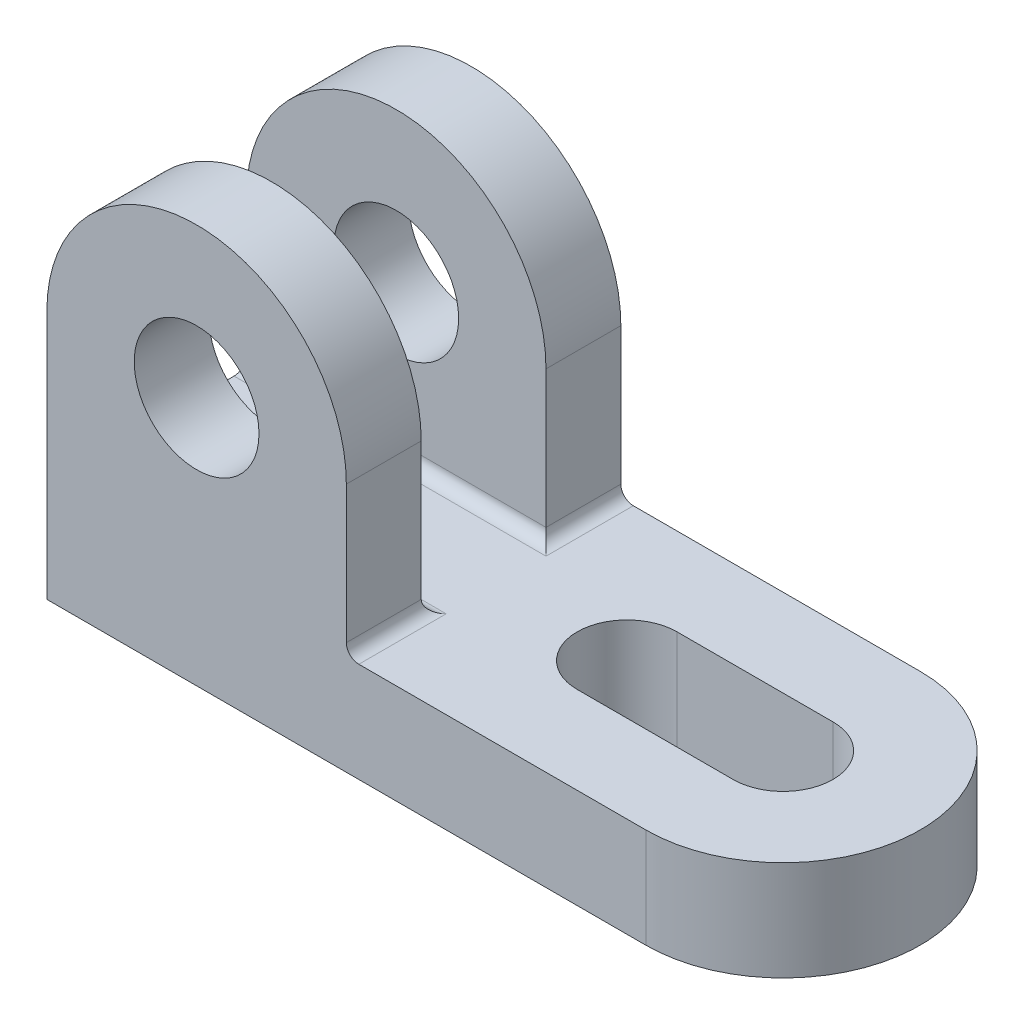
ISO-10303-21;
HEADER;
FILE_DESCRIPTION(('STEP AP214'),'2;1');
FILE_NAME('part.step','',(''),(''),'','','');
FILE_SCHEMA(('AUTOMOTIVE_DESIGN { 1 0 10303 214 1 1 1 1 }'));
ENDSEC;
DATA;
#1=APPLICATION_CONTEXT('core data for automotive mechanical design processes');
#2=APPLICATION_PROTOCOL_DEFINITION('international standard','automotive_design',2000,#1);
#3=PRODUCT_CONTEXT('',#1,'mechanical');
#4=PRODUCT('Part','Part','',(#3));
#5=PRODUCT_RELATED_PRODUCT_CATEGORY('part','',(#4));
#6=PRODUCT_DEFINITION_FORMATION('','',#4);
#7=PRODUCT_DEFINITION_CONTEXT('part definition',#1,'design');
#8=PRODUCT_DEFINITION('design','',#6,#7);
#9=PRODUCT_DEFINITION_SHAPE('','',#8);
#10=(LENGTH_UNIT() NAMED_UNIT(*) SI_UNIT(.MILLI.,.METRE.));
#11=(NAMED_UNIT(*) PLANE_ANGLE_UNIT() SI_UNIT($,.RADIAN.));
#12=(NAMED_UNIT(*) SI_UNIT($,.STERADIAN.) SOLID_ANGLE_UNIT());
#13=UNCERTAINTY_MEASURE_WITH_UNIT(LENGTH_MEASURE(1.E-05),#10,'distance_accuracy_value','');
#14=(GEOMETRIC_REPRESENTATION_CONTEXT(3) GLOBAL_UNCERTAINTY_ASSIGNED_CONTEXT((#13)) GLOBAL_UNIT_ASSIGNED_CONTEXT((#10,
#11,#12)) REPRESENTATION_CONTEXT('',''));
#15=CARTESIAN_POINT('',(0.,0.,0.));
#16=DIRECTION('',(0.,0.,1.));
#17=DIRECTION('',(1.,0.,0.));
#18=AXIS2_PLACEMENT_3D('',#15,#16,#17);
#19=CARTESIAN_POINT('',(0.,16.,0.));
#20=DIRECTION('',(0.,1.,0.));
#21=DIRECTION('',(0.,0.,1.));
#22=AXIS2_PLACEMENT_3D('',#19,#20,#21);
#23=PLANE('',#22);
#24=CARTESIAN_POINT('',(37.,16.,0.));
#25=DIRECTION('',(0.,1.,0.));
#26=DIRECTION('',(0.,0.,1.));
#27=AXIS2_PLACEMENT_3D('',#24,#25,#26);
#28=CIRCLE('',#27,7.99999999999999);
#29=CARTESIAN_POINT('',(37.,16.,7.99999999999999));
#30=VERTEX_POINT('',#29);
#31=CARTESIAN_POINT('',(37.,16.,-7.99999999999999));
#32=VERTEX_POINT('',#31);
#33=EDGE_CURVE('E249',#30,#32,#28,.T.);
#34=ORIENTED_EDGE('',*,*,#33,.F.);
#35=DIRECTION('',(1.,0.,0.));
#36=VECTOR('',#35,1.);
#37=CARTESIAN_POINT('',(37.,16.,7.99999999999999));
#38=LINE('',#37,#36);
#39=CARTESIAN_POINT('',(12.,16.,8.));
#40=VERTEX_POINT('',#39);
#41=EDGE_CURVE('E258',#40,#30,#38,.T.);
#42=ORIENTED_EDGE('',*,*,#41,.F.);
#43=CARTESIAN_POINT('',(12.,16.,0.));
#44=DIRECTION('',(0.,1.,0.));
#45=DIRECTION('',(0.,0.,1.));
#46=AXIS2_PLACEMENT_3D('',#43,#44,#45);
#47=CIRCLE('',#46,8.);
#48=CARTESIAN_POINT('',(12.,16.,-7.99999999999999));
#49=VERTEX_POINT('',#48);
#50=EDGE_CURVE('E277',#49,#40,#47,.T.);
#51=ORIENTED_EDGE('',*,*,#50,.F.);
#52=DIRECTION('',(-1.,0.,0.));
#53=VECTOR('',#52,1.);
#54=CARTESIAN_POINT('',(37.,16.,-7.99999999999999));
#55=LINE('',#54,#53);
#56=EDGE_CURVE('E273',#32,#49,#55,.T.);
#57=ORIENTED_EDGE('',*,*,#56,.F.);
#58=EDGE_LOOP('',(#34,#42,#51,#57));
#59=FACE_BOUND('',#58,.T.);
#60=DIRECTION('',(0.,0.,-1.));
#61=VECTOR('',#60,1.);
#62=CARTESIAN_POINT('',(-9.00000000000001,16.,0.));
#63=LINE('',#62,#61);
#64=CARTESIAN_POINT('',(-9.00000000000001,16.,-22.));
#65=VERTEX_POINT('',#64);
#66=CARTESIAN_POINT('',(-9.00000000000001,16.,-7.99999999999999));
#67=VERTEX_POINT('',#66);
#68=EDGE_CURVE('E345',#65,#67,#63,.F.);
#69=ORIENTED_EDGE('',*,*,#68,.T.);
#70=DIRECTION('',(-1.,0.,0.));
#71=VECTOR('',#70,1.);
#72=CARTESIAN_POINT('',(0.,16.,-7.99999999999999));
#73=LINE('',#72,#71);
#74=CARTESIAN_POINT('',(-59.,16.,-7.99999999999999));
#75=VERTEX_POINT('',#74);
#76=EDGE_CURVE('E348',#67,#75,#73,.T.);
#77=ORIENTED_EDGE('',*,*,#76,.T.);
#78=DIRECTION('',(0.,0.,1.));
#79=VECTOR('',#78,1.);
#80=CARTESIAN_POINT('',(-59.,16.,0.));
#81=LINE('',#80,#79);
#82=CARTESIAN_POINT('',(-59.,16.,7.99999999999999));
#83=VERTEX_POINT('',#82);
#84=EDGE_CURVE('E308',#75,#83,#81,.T.);
#85=ORIENTED_EDGE('',*,*,#84,.T.);
#86=DIRECTION('',(-1.,0.,0.));
#87=VECTOR('',#86,1.);
#88=CARTESIAN_POINT('',(0.,16.,7.99999999999999));
#89=LINE('',#88,#87);
#90=CARTESIAN_POINT('',(-9.00000000000001,16.,7.99999999999999));
#91=VERTEX_POINT('',#90);
#92=EDGE_CURVE('E342',#83,#91,#89,.F.);
#93=ORIENTED_EDGE('',*,*,#92,.T.);
#94=DIRECTION('',(0.,0.,1.));
#95=VECTOR('',#94,1.);
#96=CARTESIAN_POINT('',(-9.00000000000001,16.,22.));
#97=LINE('',#96,#95);
#98=CARTESIAN_POINT('',(-9.00000000000001,16.,22.));
#99=VERTEX_POINT('',#98);
#100=EDGE_CURVE('E339',#91,#99,#97,.T.);
#101=ORIENTED_EDGE('',*,*,#100,.T.);
#102=DIRECTION('',(1.,0.,0.));
#103=VECTOR('',#102,1.);
#104=CARTESIAN_POINT('',(0.,16.,22.));
#105=LINE('',#104,#103);
#106=CARTESIAN_POINT('',(37.,16.,22.));
#107=VERTEX_POINT('',#106);
#108=EDGE_CURVE('E297',#99,#107,#105,.T.);
#109=ORIENTED_EDGE('',*,*,#108,.T.);
#110=CARTESIAN_POINT('',(37.,16.,0.));
#111=DIRECTION('',(0.,1.,0.));
#112=DIRECTION('',(0.,0.,1.));
#113=AXIS2_PLACEMENT_3D('',#110,#111,#112);
#114=CIRCLE('',#113,22.);
#115=CARTESIAN_POINT('',(37.,16.,-22.));
#116=VERTEX_POINT('',#115);
#117=EDGE_CURVE('E300',#107,#116,#114,.T.);
#118=ORIENTED_EDGE('',*,*,#117,.T.);
#119=DIRECTION('',(1.,0.,0.));
#120=VECTOR('',#119,1.);
#121=CARTESIAN_POINT('',(0.,16.,-22.));
#122=LINE('',#121,#120);
#123=EDGE_CURVE('E305',#65,#116,#122,.T.);
#124=ORIENTED_EDGE('',*,*,#123,.F.);
#125=EDGE_LOOP('',(#69,#77,#85,#93,#101,#109,#118,#124));
#126=FACE_BOUND('',#125,.T.);
#127=ADVANCED_FACE('F49',(#59,#126),#23,.T.);
#128=CARTESIAN_POINT('',(0.,16.,22.));
#129=DIRECTION('',(0.,0.,-1.));
#130=DIRECTION('',(-1.,0.,0.));
#131=AXIS2_PLACEMENT_3D('',#128,#129,#130);
#132=PLANE('',#131);
#133=DIRECTION('',(1.,0.,0.));
#134=VECTOR('',#133,1.);
#135=CARTESIAN_POINT('',(0.,0.,22.));
#136=LINE('',#135,#134);
#137=CARTESIAN_POINT('',(-59.,0.,22.));
#138=VERTEX_POINT('',#137);
#139=CARTESIAN_POINT('',(37.,0.,22.));
#140=VERTEX_POINT('',#139);
#141=EDGE_CURVE('E287',#138,#140,#136,.T.);
#142=ORIENTED_EDGE('',*,*,#141,.T.);
#143=DIRECTION('',(0.,-1.,0.));
#144=VECTOR('',#143,1.);
#145=CARTESIAN_POINT('',(37.,16.,22.));
#146=LINE('',#145,#144);
#147=EDGE_CURVE('E335',#107,#140,#146,.T.);
#148=ORIENTED_EDGE('',*,*,#147,.F.);
#149=ORIENTED_EDGE('',*,*,#108,.F.);
#150=CARTESIAN_POINT('',(-9.00000000000001,18.,22.));
#151=DIRECTION('',(0.,0.,-1.));
#152=DIRECTION('',(-1.,0.,0.));
#153=AXIS2_PLACEMENT_3D('',#150,#151,#152);
#154=CIRCLE('',#153,2.);
#155=CARTESIAN_POINT('',(-11.,18.,22.));
#156=VERTEX_POINT('',#155);
#157=EDGE_CURVE('E11',#99,#156,#154,.T.);
#158=ORIENTED_EDGE('',*,*,#157,.T.);
#159=DIRECTION('',(0.,1.,0.));
#160=VECTOR('',#159,1.);
#161=CARTESIAN_POINT('',(-11.,0.,22.));
#162=LINE('',#161,#160);
#163=CARTESIAN_POINT('',(-11.,40.,22.));
#164=VERTEX_POINT('',#163);
#165=EDGE_CURVE('E239',#156,#164,#162,.T.);
#166=ORIENTED_EDGE('',*,*,#165,.T.);
#167=CARTESIAN_POINT('',(-35.,40.,22.));
#168=DIRECTION('',(0.,0.,1.));
#169=DIRECTION('',(1.,0.,0.));
#170=AXIS2_PLACEMENT_3D('',#167,#168,#169);
#171=CIRCLE('',#170,24.);
#172=CARTESIAN_POINT('',(-59.,40.,22.));
#173=VERTEX_POINT('',#172);
#174=EDGE_CURVE('E218',#164,#173,#171,.T.);
#175=ORIENTED_EDGE('',*,*,#174,.T.);
#176=DIRECTION('',(0.,-1.,0.));
#177=VECTOR('',#176,1.);
#178=CARTESIAN_POINT('',(-59.,16.,22.));
#179=LINE('',#178,#177);
#180=EDGE_CURVE('E312',#173,#138,#179,.T.);
#181=ORIENTED_EDGE('',*,*,#180,.T.);
#182=EDGE_LOOP('',(#142,#148,#149,#158,#166,#175,#181));
#183=FACE_BOUND('',#182,.T.);
#184=CARTESIAN_POINT('',(-35.,40.,22.));
#185=DIRECTION('',(0.,0.,1.));
#186=DIRECTION('',(1.,0.,0.));
#187=AXIS2_PLACEMENT_3D('',#184,#185,#186);
#188=CIRCLE('',#187,10.);
#189=CARTESIAN_POINT('',(-25.,40.,22.));
#190=VERTEX_POINT('',#189);
#191=EDGE_CURVE('E225',#190,#190,#188,.T.);
#192=ORIENTED_EDGE('',*,*,#191,.F.);
#193=EDGE_LOOP('',(#192));
#194=FACE_BOUND('',#193,.T.);
#195=ADVANCED_FACE('F385',(#183,#194),#132,.F.);
#196=CARTESIAN_POINT('',(37.,16.,0.));
#197=DIRECTION('',(0.,-1.,0.));
#198=DIRECTION('',(0.,0.,-1.));
#199=AXIS2_PLACEMENT_3D('',#196,#197,#198);
#200=CYLINDRICAL_SURFACE('',#199,22.);
#201=CARTESIAN_POINT('',(37.,0.,0.));
#202=DIRECTION('',(0.,1.,0.));
#203=DIRECTION('',(0.,0.,1.));
#204=AXIS2_PLACEMENT_3D('',#201,#202,#203);
#205=CIRCLE('',#204,22.);
#206=CARTESIAN_POINT('',(37.,0.,-22.));
#207=VERTEX_POINT('',#206);
#208=EDGE_CURVE('E316',#140,#207,#205,.T.);
#209=ORIENTED_EDGE('',*,*,#208,.T.);
#210=DIRECTION('',(0.,-1.,0.));
#211=VECTOR('',#210,1.);
#212=CARTESIAN_POINT('',(37.,16.,-22.));
#213=LINE('',#212,#211);
#214=EDGE_CURVE('E332',#116,#207,#213,.T.);
#215=ORIENTED_EDGE('',*,*,#214,.F.);
#216=ORIENTED_EDGE('',*,*,#117,.F.);
#217=ORIENTED_EDGE('',*,*,#147,.T.);
#218=EDGE_LOOP('',(#209,#215,#216,#217));
#219=FACE_BOUND('',#218,.T.);
#220=ADVANCED_FACE('F389',(#219),#200,.T.);
#221=CARTESIAN_POINT('',(0.,16.,-22.));
#222=DIRECTION('',(0.,0.,-1.));
#223=DIRECTION('',(-1.,0.,0.));
#224=AXIS2_PLACEMENT_3D('',#221,#222,#223);
#225=PLANE('',#224);
#226=DIRECTION('',(1.,0.,0.));
#227=VECTOR('',#226,1.);
#228=CARTESIAN_POINT('',(0.,0.,-22.));
#229=LINE('',#228,#227);
#230=CARTESIAN_POINT('',(-59.,0.,-22.));
#231=VERTEX_POINT('',#230);
#232=EDGE_CURVE('E320',#231,#207,#229,.T.);
#233=ORIENTED_EDGE('',*,*,#232,.F.);
#234=DIRECTION('',(0.,-1.,0.));
#235=VECTOR('',#234,1.);
#236=CARTESIAN_POINT('',(-59.,16.,-22.));
#237=LINE('',#236,#235);
#238=CARTESIAN_POINT('',(-59.,40.,-22.));
#239=VERTEX_POINT('',#238);
#240=EDGE_CURVE('E329',#239,#231,#237,.T.);
#241=ORIENTED_EDGE('',*,*,#240,.F.);
#242=CARTESIAN_POINT('',(-35.,40.,-22.));
#243=DIRECTION('',(0.,0.,1.));
#244=DIRECTION('',(1.,0.,0.));
#245=AXIS2_PLACEMENT_3D('',#242,#243,#244);
#246=CIRCLE('',#245,24.);
#247=CARTESIAN_POINT('',(-11.,40.,-22.));
#248=VERTEX_POINT('',#247);
#249=EDGE_CURVE('E211',#248,#239,#246,.T.);
#250=ORIENTED_EDGE('',*,*,#249,.F.);
#251=DIRECTION('',(0.,1.,0.));
#252=VECTOR('',#251,1.);
#253=CARTESIAN_POINT('',(-11.,0.,-22.));
#254=LINE('',#253,#252);
#255=CARTESIAN_POINT('',(-11.,18.,-22.));
#256=VERTEX_POINT('',#255);
#257=EDGE_CURVE('E189',#256,#248,#254,.T.);
#258=ORIENTED_EDGE('',*,*,#257,.F.);
#259=CARTESIAN_POINT('',(-9.00000000000001,18.,-22.));
#260=DIRECTION('',(0.,0.,-1.));
#261=DIRECTION('',(-1.,0.,0.));
#262=AXIS2_PLACEMENT_3D('',#259,#260,#261);
#263=CIRCLE('',#262,2.);
#264=EDGE_CURVE('E366',#256,#65,#263,.F.);
#265=ORIENTED_EDGE('',*,*,#264,.T.);
#266=ORIENTED_EDGE('',*,*,#123,.T.);
#267=ORIENTED_EDGE('',*,*,#214,.T.);
#268=EDGE_LOOP('',(#233,#241,#250,#258,#265,#266,#267));
#269=FACE_BOUND('',#268,.T.);
#270=CARTESIAN_POINT('',(-35.,40.,-22.));
#271=DIRECTION('',(0.,0.,1.));
#272=DIRECTION('',(1.,0.,0.));
#273=AXIS2_PLACEMENT_3D('',#270,#271,#272);
#274=CIRCLE('',#273,10.);
#275=CARTESIAN_POINT('',(-25.,40.,-22.));
#276=VERTEX_POINT('',#275);
#277=EDGE_CURVE('E200',#276,#276,#274,.T.);
#278=ORIENTED_EDGE('',*,*,#277,.T.);
#279=EDGE_LOOP('',(#278));
#280=FACE_BOUND('',#279,.T.);
#281=ADVANCED_FACE('F418',(#269,#280),#225,.T.);
#282=CARTESIAN_POINT('',(-59.,16.,0.));
#283=DIRECTION('',(1.,0.,0.));
#284=DIRECTION('',(0.,0.,-1.));
#285=AXIS2_PLACEMENT_3D('',#282,#283,#284);
#286=PLANE('',#285);
#287=DIRECTION('',(0.,0.,1.));
#288=VECTOR('',#287,1.);
#289=CARTESIAN_POINT('',(-59.,0.,0.));
#290=LINE('',#289,#288);
#291=EDGE_CURVE('E301',#231,#138,#290,.T.);
#292=ORIENTED_EDGE('',*,*,#291,.T.);
#293=ORIENTED_EDGE('',*,*,#180,.F.);
#294=DIRECTION('',(0.,0.,1.));
#295=VECTOR('',#294,1.);
#296=CARTESIAN_POINT('',(-59.,40.,9.99999999999999));
#297=LINE('',#296,#295);
#298=CARTESIAN_POINT('',(-59.,40.,9.99999999999999));
#299=VERTEX_POINT('',#298);
#300=EDGE_CURVE('E235',#299,#173,#297,.T.);
#301=ORIENTED_EDGE('',*,*,#300,.F.);
#302=DIRECTION('',(0.,1.,0.));
#303=VECTOR('',#302,1.);
#304=CARTESIAN_POINT('',(-59.,0.,9.99999999999999));
#305=LINE('',#304,#303);
#306=CARTESIAN_POINT('',(-59.,18.,9.99999999999999));
#307=VERTEX_POINT('',#306);
#308=EDGE_CURVE('E224',#307,#299,#305,.T.);
#309=ORIENTED_EDGE('',*,*,#308,.F.);
#310=CARTESIAN_POINT('',(-59.,18.,7.99999999999999));
#311=DIRECTION('',(1.,0.,0.));
#312=DIRECTION('',(0.,0.,-1.));
#313=AXIS2_PLACEMENT_3D('',#310,#311,#312);
#314=CIRCLE('',#313,2.);
#315=EDGE_CURVE('E59',#307,#83,#314,.T.);
#316=ORIENTED_EDGE('',*,*,#315,.T.);
#317=ORIENTED_EDGE('',*,*,#84,.F.);
#318=CARTESIAN_POINT('',(-59.,18.,-7.99999999999999));
#319=DIRECTION('',(1.,0.,0.));
#320=DIRECTION('',(0.,0.,-1.));
#321=AXIS2_PLACEMENT_3D('',#318,#319,#320);
#322=CIRCLE('',#321,2.);
#323=CARTESIAN_POINT('',(-59.,18.,-9.99999999999999));
#324=VERTEX_POINT('',#323);
#325=EDGE_CURVE('E363',#75,#324,#322,.T.);
#326=ORIENTED_EDGE('',*,*,#325,.T.);
#327=DIRECTION('',(0.,1.,0.));
#328=VECTOR('',#327,1.);
#329=CARTESIAN_POINT('',(-59.,0.,-9.99999999999999));
#330=LINE('',#329,#328);
#331=CARTESIAN_POINT('',(-59.,40.,-9.99999999999999));
#332=VERTEX_POINT('',#331);
#333=EDGE_CURVE('E183',#324,#332,#330,.T.);
#334=ORIENTED_EDGE('',*,*,#333,.T.);
#335=DIRECTION('',(0.,0.,-1.));
#336=VECTOR('',#335,1.);
#337=CARTESIAN_POINT('',(-59.,40.,-9.99999999999999));
#338=LINE('',#337,#336);
#339=EDGE_CURVE('E194',#332,#239,#338,.T.);
#340=ORIENTED_EDGE('',*,*,#339,.T.);
#341=ORIENTED_EDGE('',*,*,#240,.T.);
#342=EDGE_LOOP('',(#292,#293,#301,#309,#316,#317,#326,#334,#340,#341));
#343=FACE_BOUND('',#342,.T.);
#344=ADVANCED_FACE('F400',(#343),#286,.F.);
#345=CARTESIAN_POINT('',(0.,0.,0.));
#346=DIRECTION('',(0.,1.,0.));
#347=DIRECTION('',(0.,0.,1.));
#348=AXIS2_PLACEMENT_3D('',#345,#346,#347);
#349=PLANE('',#348);
#350=DIRECTION('',(1.,0.,0.));
#351=VECTOR('',#350,1.);
#352=CARTESIAN_POINT('',(37.,0.,7.99999999999999));
#353=LINE('',#352,#351);
#354=CARTESIAN_POINT('',(12.,0.,8.));
#355=VERTEX_POINT('',#354);
#356=CARTESIAN_POINT('',(37.,0.,7.99999999999999));
#357=VERTEX_POINT('',#356);
#358=EDGE_CURVE('E266',#355,#357,#353,.T.);
#359=ORIENTED_EDGE('',*,*,#358,.T.);
#360=CARTESIAN_POINT('',(37.,0.,0.));
#361=DIRECTION('',(0.,1.,0.));
#362=DIRECTION('',(0.,0.,1.));
#363=AXIS2_PLACEMENT_3D('',#360,#361,#362);
#364=CIRCLE('',#363,7.99999999999999);
#365=CARTESIAN_POINT('',(37.,0.,-7.99999999999999));
#366=VERTEX_POINT('',#365);
#367=EDGE_CURVE('E253',#357,#366,#364,.T.);
#368=ORIENTED_EDGE('',*,*,#367,.T.);
#369=DIRECTION('',(-1.,0.,0.));
#370=VECTOR('',#369,1.);
#371=CARTESIAN_POINT('',(37.,0.,-7.99999999999999));
#372=LINE('',#371,#370);
#373=CARTESIAN_POINT('',(12.,0.,-7.99999999999999));
#374=VERTEX_POINT('',#373);
#375=EDGE_CURVE('E257',#366,#374,#372,.T.);
#376=ORIENTED_EDGE('',*,*,#375,.T.);
#377=CARTESIAN_POINT('',(12.,0.,0.));
#378=DIRECTION('',(0.,1.,0.));
#379=DIRECTION('',(0.,0.,1.));
#380=AXIS2_PLACEMENT_3D('',#377,#378,#379);
#381=CIRCLE('',#380,8.);
#382=EDGE_CURVE('E262',#374,#355,#381,.T.);
#383=ORIENTED_EDGE('',*,*,#382,.T.);
#384=EDGE_LOOP('',(#359,#368,#376,#383));
#385=FACE_BOUND('',#384,.T.);
#386=ORIENTED_EDGE('',*,*,#141,.F.);
#387=ORIENTED_EDGE('',*,*,#291,.F.);
#388=ORIENTED_EDGE('',*,*,#232,.T.);
#389=ORIENTED_EDGE('',*,*,#208,.F.);
#390=EDGE_LOOP('',(#386,#387,#388,#389));
#391=FACE_BOUND('',#390,.T.);
#392=ADVANCED_FACE('F416',(#385,#391),#349,.F.);
#393=CARTESIAN_POINT('',(37.,0.,0.));
#394=DIRECTION('',(0.,1.,0.));
#395=DIRECTION('',(0.,0.,1.));
#396=AXIS2_PLACEMENT_3D('',#393,#394,#395);
#397=CYLINDRICAL_SURFACE('',#396,7.99999999999999);
#398=ORIENTED_EDGE('',*,*,#33,.T.);
#399=DIRECTION('',(0.,1.,0.));
#400=VECTOR('',#399,1.);
#401=CARTESIAN_POINT('',(37.,0.,-7.99999999999999));
#402=LINE('',#401,#400);
#403=EDGE_CURVE('E270',#366,#32,#402,.T.);
#404=ORIENTED_EDGE('',*,*,#403,.F.);
#405=ORIENTED_EDGE('',*,*,#367,.F.);
#406=DIRECTION('',(0.,1.,0.));
#407=VECTOR('',#406,1.);
#408=CARTESIAN_POINT('',(37.,0.,7.99999999999999));
#409=LINE('',#408,#407);
#410=EDGE_CURVE('E284',#357,#30,#409,.T.);
#411=ORIENTED_EDGE('',*,*,#410,.T.);
#412=EDGE_LOOP('',(#398,#404,#405,#411));
#413=FACE_BOUND('',#412,.T.);
#414=ADVANCED_FACE('F444',(#413),#397,.F.);
#415=CARTESIAN_POINT('',(37.,0.,7.99999999999999));
#416=DIRECTION('',(0.,0.,1.));
#417=DIRECTION('',(1.,0.,0.));
#418=AXIS2_PLACEMENT_3D('',#415,#416,#417);
#419=PLANE('',#418);
#420=ORIENTED_EDGE('',*,*,#41,.T.);
#421=ORIENTED_EDGE('',*,*,#410,.F.);
#422=ORIENTED_EDGE('',*,*,#358,.F.);
#423=DIRECTION('',(0.,1.,0.));
#424=VECTOR('',#423,1.);
#425=CARTESIAN_POINT('',(12.,0.,8.));
#426=LINE('',#425,#424);
#427=EDGE_CURVE('E288',#355,#40,#426,.T.);
#428=ORIENTED_EDGE('',*,*,#427,.T.);
#429=EDGE_LOOP('',(#420,#421,#422,#428));
#430=FACE_BOUND('',#429,.T.);
#431=ADVANCED_FACE('F578',(#430),#419,.F.);
#432=CARTESIAN_POINT('',(12.,0.,0.));
#433=DIRECTION('',(0.,1.,0.));
#434=DIRECTION('',(0.,0.,1.));
#435=AXIS2_PLACEMENT_3D('',#432,#433,#434);
#436=CYLINDRICAL_SURFACE('',#435,8.);
#437=ORIENTED_EDGE('',*,*,#50,.T.);
#438=ORIENTED_EDGE('',*,*,#427,.F.);
#439=ORIENTED_EDGE('',*,*,#382,.F.);
#440=DIRECTION('',(0.,1.,0.));
#441=VECTOR('',#440,1.);
#442=CARTESIAN_POINT('',(12.,0.,-7.99999999999999));
#443=LINE('',#442,#441);
#444=EDGE_CURVE('E291',#374,#49,#443,.T.);
#445=ORIENTED_EDGE('',*,*,#444,.T.);
#446=EDGE_LOOP('',(#437,#438,#439,#445));
#447=FACE_BOUND('',#446,.T.);
#448=ADVANCED_FACE('F567',(#447),#436,.F.);
#449=CARTESIAN_POINT('',(37.,0.,-7.99999999999999));
#450=DIRECTION('',(0.,0.,-1.));
#451=DIRECTION('',(-1.,0.,0.));
#452=AXIS2_PLACEMENT_3D('',#449,#450,#451);
#453=PLANE('',#452);
#454=ORIENTED_EDGE('',*,*,#56,.T.);
#455=ORIENTED_EDGE('',*,*,#444,.F.);
#456=ORIENTED_EDGE('',*,*,#375,.F.);
#457=ORIENTED_EDGE('',*,*,#403,.T.);
#458=EDGE_LOOP('',(#454,#455,#456,#457));
#459=FACE_BOUND('',#458,.T.);
#460=ADVANCED_FACE('F557',(#459),#453,.F.);
#461=CARTESIAN_POINT('',(-35.,40.,9.99999999999999));
#462=DIRECTION('',(0.,0.,1.));
#463=DIRECTION('',(1.,0.,0.));
#464=AXIS2_PLACEMENT_3D('',#461,#462,#463);
#465=CYLINDRICAL_SURFACE('',#464,24.);
#466=ORIENTED_EDGE('',*,*,#174,.F.);
#467=DIRECTION('',(0.,0.,1.));
#468=VECTOR('',#467,1.);
#469=CARTESIAN_POINT('',(-11.,40.,9.99999999999999));
#470=LINE('',#469,#468);
#471=CARTESIAN_POINT('',(-11.,40.,9.99999999999999));
#472=VERTEX_POINT('',#471);
#473=EDGE_CURVE('E245',#472,#164,#470,.T.);
#474=ORIENTED_EDGE('',*,*,#473,.F.);
#475=CARTESIAN_POINT('',(-35.,40.,9.99999999999999));
#476=DIRECTION('',(0.,0.,1.));
#477=DIRECTION('',(1.,0.,0.));
#478=AXIS2_PLACEMENT_3D('',#475,#476,#477);
#479=CIRCLE('',#478,24.);
#480=EDGE_CURVE('E220',#472,#299,#479,.T.);
#481=ORIENTED_EDGE('',*,*,#480,.T.);
#482=ORIENTED_EDGE('',*,*,#300,.T.);
#483=EDGE_LOOP('',(#466,#474,#481,#482));
#484=FACE_BOUND('',#483,.T.);
#485=ADVANCED_FACE('F413',(#484),#465,.T.);
#486=CARTESIAN_POINT('',(-11.,0.,9.99999999999999));
#487=DIRECTION('',(1.,0.,0.));
#488=DIRECTION('',(0.,1.,0.));
#489=AXIS2_PLACEMENT_3D('',#486,#487,#488);
#490=PLANE('',#489);
#491=ORIENTED_EDGE('',*,*,#165,.F.);
#492=DIRECTION('',(0.,0.,1.));
#493=VECTOR('',#492,1.);
#494=CARTESIAN_POINT('',(-11.,18.,9.99999999999999));
#495=LINE('',#494,#493);
#496=CARTESIAN_POINT('',(-11.,18.,9.99999999999999));
#497=VERTEX_POINT('',#496);
#498=EDGE_CURVE('E360',#156,#497,#495,.F.);
#499=ORIENTED_EDGE('',*,*,#498,.T.);
#500=DIRECTION('',(0.,1.,0.));
#501=VECTOR('',#500,1.);
#502=CARTESIAN_POINT('',(-11.,0.,9.99999999999999));
#503=LINE('',#502,#501);
#504=EDGE_CURVE('E228',#497,#472,#503,.T.);
#505=ORIENTED_EDGE('',*,*,#504,.T.);
#506=ORIENTED_EDGE('',*,*,#473,.T.);
#507=EDGE_LOOP('',(#491,#499,#505,#506));
#508=FACE_BOUND('',#507,.T.);
#509=ADVANCED_FACE('F410',(#508),#490,.T.);
#510=CARTESIAN_POINT('',(-35.,40.,9.99999999999999));
#511=DIRECTION('',(0.,0.,1.));
#512=DIRECTION('',(1.,0.,0.));
#513=AXIS2_PLACEMENT_3D('',#510,#511,#512);
#514=CYLINDRICAL_SURFACE('',#513,10.);
#515=CARTESIAN_POINT('',(-35.,40.,9.99999999999999));
#516=DIRECTION('',(0.,0.,1.));
#517=DIRECTION('',(1.,0.,0.));
#518=AXIS2_PLACEMENT_3D('',#515,#516,#517);
#519=CIRCLE('',#518,10.);
#520=CARTESIAN_POINT('',(-25.,40.,9.99999999999999));
#521=VERTEX_POINT('',#520);
#522=EDGE_CURVE('E231',#521,#521,#519,.T.);
#523=ORIENTED_EDGE('',*,*,#522,.F.);
#524=EDGE_LOOP('',(#523));
#525=FACE_BOUND('',#524,.T.);
#526=ORIENTED_EDGE('',*,*,#191,.T.);
#527=EDGE_LOOP('',(#526));
#528=FACE_BOUND('',#527,.T.);
#529=ADVANCED_FACE('F494',(#525,#528),#514,.F.);
#530=CARTESIAN_POINT('',(0.,0.,9.99999999999999));
#531=DIRECTION('',(0.,0.,1.));
#532=DIRECTION('',(1.,0.,0.));
#533=AXIS2_PLACEMENT_3D('',#530,#531,#532);
#534=PLANE('',#533);
#535=ORIENTED_EDGE('',*,*,#504,.F.);
#536=DIRECTION('',(-1.,0.,0.));
#537=VECTOR('',#536,1.);
#538=CARTESIAN_POINT('',(0.,18.,9.99999999999999));
#539=LINE('',#538,#537);
#540=EDGE_CURVE('E357',#497,#307,#539,.T.);
#541=ORIENTED_EDGE('',*,*,#540,.T.);
#542=ORIENTED_EDGE('',*,*,#308,.T.);
#543=ORIENTED_EDGE('',*,*,#480,.F.);
#544=EDGE_LOOP('',(#535,#541,#542,#543));
#545=FACE_BOUND('',#544,.T.);
#546=ORIENTED_EDGE('',*,*,#522,.T.);
#547=EDGE_LOOP('',(#546));
#548=FACE_BOUND('',#547,.T.);
#549=ADVANCED_FACE('F406',(#545,#548),#534,.F.);
#550=CARTESIAN_POINT('',(-35.,40.,-9.99999999999999));
#551=DIRECTION('',(0.,0.,-1.));
#552=DIRECTION('',(-1.,0.,0.));
#553=AXIS2_PLACEMENT_3D('',#550,#551,#552);
#554=CYLINDRICAL_SURFACE('',#553,24.);
#555=ORIENTED_EDGE('',*,*,#249,.T.);
#556=ORIENTED_EDGE('',*,*,#339,.F.);
#557=CARTESIAN_POINT('',(-35.,40.,-9.99999999999999));
#558=DIRECTION('',(0.,0.,1.));
#559=DIRECTION('',(1.,0.,0.));
#560=AXIS2_PLACEMENT_3D('',#557,#558,#559);
#561=CIRCLE('',#560,24.);
#562=CARTESIAN_POINT('',(-11.,40.,-9.99999999999999));
#563=VERTEX_POINT('',#562);
#564=EDGE_CURVE('E176',#563,#332,#561,.T.);
#565=ORIENTED_EDGE('',*,*,#564,.F.);
#566=DIRECTION('',(0.,0.,-1.));
#567=VECTOR('',#566,1.);
#568=CARTESIAN_POINT('',(-11.,40.,-9.99999999999999));
#569=LINE('',#568,#567);
#570=EDGE_CURVE('E186',#563,#248,#569,.T.);
#571=ORIENTED_EDGE('',*,*,#570,.T.);
#572=EDGE_LOOP('',(#555,#556,#565,#571));
#573=FACE_BOUND('',#572,.T.);
#574=ADVANCED_FACE('F197',(#573),#554,.T.);
#575=CARTESIAN_POINT('',(-11.,0.,-9.99999999999999));
#576=DIRECTION('',(-1.,0.,0.));
#577=DIRECTION('',(0.,-1.,0.));
#578=AXIS2_PLACEMENT_3D('',#575,#576,#577);
#579=PLANE('',#578);
#580=DIRECTION('',(0.,1.,0.));
#581=VECTOR('',#580,1.);
#582=CARTESIAN_POINT('',(-11.,0.,-9.99999999999999));
#583=LINE('',#582,#581);
#584=CARTESIAN_POINT('',(-11.,18.,-9.99999999999999));
#585=VERTEX_POINT('',#584);
#586=EDGE_CURVE('E170',#585,#563,#583,.T.);
#587=ORIENTED_EDGE('',*,*,#586,.F.);
#588=DIRECTION('',(0.,0.,-1.));
#589=VECTOR('',#588,1.);
#590=CARTESIAN_POINT('',(-11.,18.,-9.99999999999999));
#591=LINE('',#590,#589);
#592=EDGE_CURVE('E354',#585,#256,#591,.T.);
#593=ORIENTED_EDGE('',*,*,#592,.T.);
#594=ORIENTED_EDGE('',*,*,#257,.T.);
#595=ORIENTED_EDGE('',*,*,#570,.F.);
#596=EDGE_LOOP('',(#587,#593,#594,#595));
#597=FACE_BOUND('',#596,.T.);
#598=ADVANCED_FACE('F187',(#597),#579,.F.);
#599=CARTESIAN_POINT('',(-35.,40.,-9.99999999999999));
#600=DIRECTION('',(0.,0.,-1.));
#601=DIRECTION('',(-1.,0.,0.));
#602=AXIS2_PLACEMENT_3D('',#599,#600,#601);
#603=CYLINDRICAL_SURFACE('',#602,10.);
#604=CARTESIAN_POINT('',(-35.,40.,-9.99999999999999));
#605=DIRECTION('',(0.,0.,1.));
#606=DIRECTION('',(1.,0.,0.));
#607=AXIS2_PLACEMENT_3D('',#604,#605,#606);
#608=CIRCLE('',#607,10.);
#609=CARTESIAN_POINT('',(-25.,40.,-9.99999999999999));
#610=VERTEX_POINT('',#609);
#611=EDGE_CURVE('E195',#610,#610,#608,.T.);
#612=ORIENTED_EDGE('',*,*,#611,.T.);
#613=EDGE_LOOP('',(#612));
#614=FACE_BOUND('',#613,.T.);
#615=ORIENTED_EDGE('',*,*,#277,.F.);
#616=EDGE_LOOP('',(#615));
#617=FACE_BOUND('',#616,.T.);
#618=ADVANCED_FACE('F424',(#614,#617),#603,.F.);
#619=CARTESIAN_POINT('',(0.,0.,-9.99999999999999));
#620=DIRECTION('',(0.,0.,-1.));
#621=DIRECTION('',(1.,0.,0.));
#622=AXIS2_PLACEMENT_3D('',#619,#620,#621);
#623=PLANE('',#622);
#624=ORIENTED_EDGE('',*,*,#333,.F.);
#625=DIRECTION('',(-1.,0.,0.));
#626=VECTOR('',#625,1.);
#627=CARTESIAN_POINT('',(0.,18.,-9.99999999999999));
#628=LINE('',#627,#626);
#629=EDGE_CURVE('E179',#324,#585,#628,.F.);
#630=ORIENTED_EDGE('',*,*,#629,.T.);
#631=ORIENTED_EDGE('',*,*,#586,.T.);
#632=ORIENTED_EDGE('',*,*,#564,.T.);
#633=EDGE_LOOP('',(#624,#630,#631,#632));
#634=FACE_BOUND('',#633,.T.);
#635=ORIENTED_EDGE('',*,*,#611,.F.);
#636=EDGE_LOOP('',(#635));
#637=FACE_BOUND('',#636,.T.);
#638=ADVANCED_FACE('F173',(#634,#637),#623,.F.);
#639=CARTESIAN_POINT('',(-9.00000000000001,18.,-9.99999999999999));
#640=DIRECTION('',(0.,0.,-1.));
#641=DIRECTION('',(-1.,0.,0.));
#642=AXIS2_PLACEMENT_3D('',#639,#640,#641);
#643=CYLINDRICAL_SURFACE('',#642,2.);
#644=ORIENTED_EDGE('',*,*,#264,.F.);
#645=ORIENTED_EDGE('',*,*,#592,.F.);
#646=CARTESIAN_POINT('',(-9.00000000000001,18.,-7.99999999999999));
#647=DIRECTION('',(0.707106781186547,0.,-0.707106781186547));
#648=DIRECTION('',(-0.707106781186547,0.,-0.707106781186547));
#649=AXIS2_PLACEMENT_3D('',#646,#647,#648);
#650=ELLIPSE('',#649,2.82842712474619,2.);
#651=EDGE_CURVE('E214',#67,#585,#650,.T.);
#652=ORIENTED_EDGE('',*,*,#651,.F.);
#653=ORIENTED_EDGE('',*,*,#68,.F.);
#654=EDGE_LOOP('',(#644,#645,#652,#653));
#655=FACE_BOUND('',#654,.T.);
#656=ADVANCED_FACE('F396',(#655),#643,.F.);
#657=CARTESIAN_POINT('',(0.,18.,-7.99999999999999));
#658=DIRECTION('',(-1.,0.,0.));
#659=DIRECTION('',(0.,0.,1.));
#660=AXIS2_PLACEMENT_3D('',#657,#658,#659);
#661=CYLINDRICAL_SURFACE('',#660,2.);
#662=ORIENTED_EDGE('',*,*,#651,.T.);
#663=ORIENTED_EDGE('',*,*,#629,.F.);
#664=ORIENTED_EDGE('',*,*,#325,.F.);
#665=ORIENTED_EDGE('',*,*,#76,.F.);
#666=EDGE_LOOP('',(#662,#663,#664,#665));
#667=FACE_BOUND('',#666,.T.);
#668=ADVANCED_FACE('F397',(#667),#661,.F.);
#669=CARTESIAN_POINT('',(-9.00000000000001,18.,0.));
#670=DIRECTION('',(0.,0.,-1.));
#671=DIRECTION('',(-1.,0.,0.));
#672=AXIS2_PLACEMENT_3D('',#669,#670,#671);
#673=CYLINDRICAL_SURFACE('',#672,2.);
#674=ORIENTED_EDGE('',*,*,#157,.F.);
#675=ORIENTED_EDGE('',*,*,#100,.F.);
#676=CARTESIAN_POINT('',(-9.00000000000001,18.,7.99999999999999));
#677=DIRECTION('',(-0.707106781186547,0.,-0.707106781186547));
#678=DIRECTION('',(0.707106781186547,0.,-0.707106781186547));
#679=AXIS2_PLACEMENT_3D('',#676,#677,#678);
#680=ELLIPSE('',#679,2.82842712474619,2.);
#681=EDGE_CURVE('E53',#497,#91,#680,.F.);
#682=ORIENTED_EDGE('',*,*,#681,.F.);
#683=ORIENTED_EDGE('',*,*,#498,.F.);
#684=EDGE_LOOP('',(#674,#675,#682,#683));
#685=FACE_BOUND('',#684,.T.);
#686=ADVANCED_FACE('F51',(#685),#673,.F.);
#687=CARTESIAN_POINT('',(0.,18.,7.99999999999999));
#688=DIRECTION('',(-1.,0.,0.));
#689=DIRECTION('',(0.,0.,1.));
#690=AXIS2_PLACEMENT_3D('',#687,#688,#689);
#691=CYLINDRICAL_SURFACE('',#690,2.);
#692=ORIENTED_EDGE('',*,*,#681,.T.);
#693=ORIENTED_EDGE('',*,*,#92,.F.);
#694=ORIENTED_EDGE('',*,*,#315,.F.);
#695=ORIENTED_EDGE('',*,*,#540,.F.);
#696=EDGE_LOOP('',(#692,#693,#694,#695));
#697=FACE_BOUND('',#696,.T.);
#698=ADVANCED_FACE('F378',(#697),#691,.F.);
#699=CLOSED_SHELL('',(#127,#195,#220,#281,#344,#392,#414,#431,#448,#460,#485,#509,#529,#549,
#574,#598,#618,#638,#656,#668,#686,#698));
#700=MANIFOLD_SOLID_BREP('B2',#699);
#701=ADVANCED_BREP_SHAPE_REPRESENTATION('',(#18,#700),#14);
#702=SHAPE_DEFINITION_REPRESENTATION(#9,#701);
ENDSEC;
END-ISO-10303-21;
